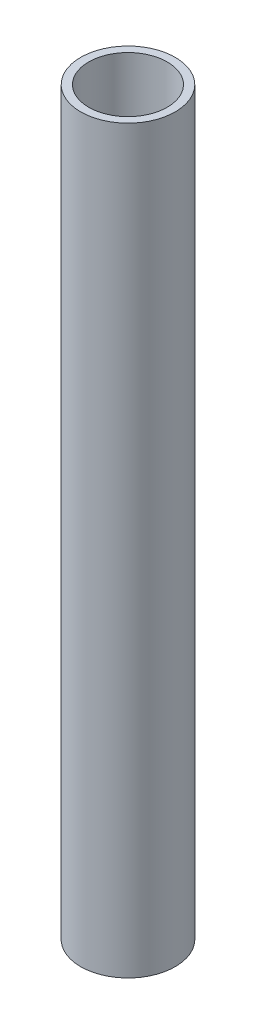
ISO-10303-21;
HEADER;
FILE_DESCRIPTION(('STEP AP214'),'2;1');
FILE_NAME('part.step','',(''),(''),'','','');
FILE_SCHEMA(('AUTOMOTIVE_DESIGN { 1 0 10303 214 1 1 1 1 }'));
ENDSEC;
DATA;
#1=APPLICATION_CONTEXT('core data for automotive mechanical design processes');
#2=APPLICATION_PROTOCOL_DEFINITION('international standard','automotive_design',2000,#1);
#3=PRODUCT_CONTEXT('',#1,'mechanical');
#4=PRODUCT('Part','Part','',(#3));
#5=PRODUCT_RELATED_PRODUCT_CATEGORY('part','',(#4));
#6=PRODUCT_DEFINITION_FORMATION('','',#4);
#7=PRODUCT_DEFINITION_CONTEXT('part definition',#1,'design');
#8=PRODUCT_DEFINITION('design','',#6,#7);
#9=PRODUCT_DEFINITION_SHAPE('','',#8);
#10=(LENGTH_UNIT() NAMED_UNIT(*) SI_UNIT(.MILLI.,.METRE.));
#11=(NAMED_UNIT(*) PLANE_ANGLE_UNIT() SI_UNIT($,.RADIAN.));
#12=(NAMED_UNIT(*) SI_UNIT($,.STERADIAN.) SOLID_ANGLE_UNIT());
#13=UNCERTAINTY_MEASURE_WITH_UNIT(LENGTH_MEASURE(1.E-05),#10,'distance_accuracy_value','');
#14=(GEOMETRIC_REPRESENTATION_CONTEXT(3) GLOBAL_UNCERTAINTY_ASSIGNED_CONTEXT((#13)) GLOBAL_UNIT_ASSIGNED_CONTEXT((#10,
#11,#12)) REPRESENTATION_CONTEXT('',''));
#15=CARTESIAN_POINT('',(0.,0.,0.));
#16=DIRECTION('',(0.,0.,1.));
#17=DIRECTION('',(1.,0.,0.));
#18=AXIS2_PLACEMENT_3D('',#15,#16,#17);
#19=CARTESIAN_POINT('',(0.,330.2,0.));
#20=DIRECTION('',(0.,1.,0.));
#21=DIRECTION('',(0.,0.,1.));
#22=AXIS2_PLACEMENT_3D('',#19,#20,#21);
#23=PLANE('',#22);
#24=CARTESIAN_POINT('',(0.,330.2,0.));
#25=DIRECTION('',(0.,1.,0.));
#26=DIRECTION('',(0.,0.,1.));
#27=AXIS2_PLACEMENT_3D('',#24,#25,#26);
#28=CIRCLE('',#27,21.082);
#29=CARTESIAN_POINT('',(0.,330.2,21.082));
#30=VERTEX_POINT('',#29);
#31=EDGE_CURVE('E10',#30,#30,#28,.T.);
#32=ORIENTED_EDGE('',*,*,#31,.T.);
#33=EDGE_LOOP('',(#32));
#34=FACE_BOUND('',#33,.T.);
#35=CARTESIAN_POINT('',(0.,330.2,0.));
#36=DIRECTION('',(0.,1.,0.));
#37=DIRECTION('',(0.,0.,1.));
#38=AXIS2_PLACEMENT_3D('',#35,#36,#37);
#39=CIRCLE('',#38,17.526);
#40=CARTESIAN_POINT('',(0.,330.2,17.526));
#41=VERTEX_POINT('',#40);
#42=EDGE_CURVE('E41',#41,#41,#39,.T.);
#43=ORIENTED_EDGE('',*,*,#42,.F.);
#44=EDGE_LOOP('',(#43));
#45=FACE_BOUND('',#44,.T.);
#46=ADVANCED_FACE('F30',(#34,#45),#23,.T.);
#47=CARTESIAN_POINT('',(0.,0.,0.));
#48=DIRECTION('',(0.,1.,0.));
#49=DIRECTION('',(0.,0.,1.));
#50=AXIS2_PLACEMENT_3D('',#47,#48,#49);
#51=PLANE('',#50);
#52=CARTESIAN_POINT('',(0.,0.,0.));
#53=DIRECTION('',(0.,1.,0.));
#54=DIRECTION('',(0.,0.,1.));
#55=AXIS2_PLACEMENT_3D('',#52,#53,#54);
#56=CIRCLE('',#55,21.082);
#57=CARTESIAN_POINT('',(0.,0.,21.082));
#58=VERTEX_POINT('',#57);
#59=EDGE_CURVE('E34',#58,#58,#56,.T.);
#60=ORIENTED_EDGE('',*,*,#59,.F.);
#61=EDGE_LOOP('',(#60));
#62=FACE_BOUND('',#61,.T.);
#63=CARTESIAN_POINT('',(0.,0.,0.));
#64=DIRECTION('',(0.,1.,0.));
#65=DIRECTION('',(0.,0.,1.));
#66=AXIS2_PLACEMENT_3D('',#63,#64,#65);
#67=CIRCLE('',#66,17.526);
#68=CARTESIAN_POINT('',(0.,0.,17.526));
#69=VERTEX_POINT('',#68);
#70=EDGE_CURVE('E43',#69,#69,#67,.T.);
#71=ORIENTED_EDGE('',*,*,#70,.T.);
#72=EDGE_LOOP('',(#71));
#73=FACE_BOUND('',#72,.T.);
#74=ADVANCED_FACE('F53',(#62,#73),#51,.F.);
#75=CARTESIAN_POINT('',(0.,330.2,0.));
#76=DIRECTION('',(0.,-1.,0.));
#77=DIRECTION('',(0.,0.,-1.));
#78=AXIS2_PLACEMENT_3D('',#75,#76,#77);
#79=CYLINDRICAL_SURFACE('',#78,21.082);
#80=ORIENTED_EDGE('',*,*,#31,.F.);
#81=EDGE_LOOP('',(#80));
#82=FACE_BOUND('',#81,.T.);
#83=ORIENTED_EDGE('',*,*,#59,.T.);
#84=EDGE_LOOP('',(#83));
#85=FACE_BOUND('',#84,.T.);
#86=ADVANCED_FACE('F32',(#82,#85),#79,.T.);
#87=CARTESIAN_POINT('',(0.,330.2,0.));
#88=DIRECTION('',(0.,-1.,0.));
#89=DIRECTION('',(0.,0.,-1.));
#90=AXIS2_PLACEMENT_3D('',#87,#88,#89);
#91=CYLINDRICAL_SURFACE('',#90,17.526);
#92=ORIENTED_EDGE('',*,*,#42,.T.);
#93=EDGE_LOOP('',(#92));
#94=FACE_BOUND('',#93,.T.);
#95=ORIENTED_EDGE('',*,*,#70,.F.);
#96=EDGE_LOOP('',(#95));
#97=FACE_BOUND('',#96,.T.);
#98=ADVANCED_FACE('F49',(#94,#97),#91,.F.);
#99=CLOSED_SHELL('',(#46,#74,#86,#98));
#100=MANIFOLD_SOLID_BREP('B2',#99);
#101=ADVANCED_BREP_SHAPE_REPRESENTATION('',(#18,#100),#14);
#102=SHAPE_DEFINITION_REPRESENTATION(#9,#101);
ENDSEC;
END-ISO-10303-21;
